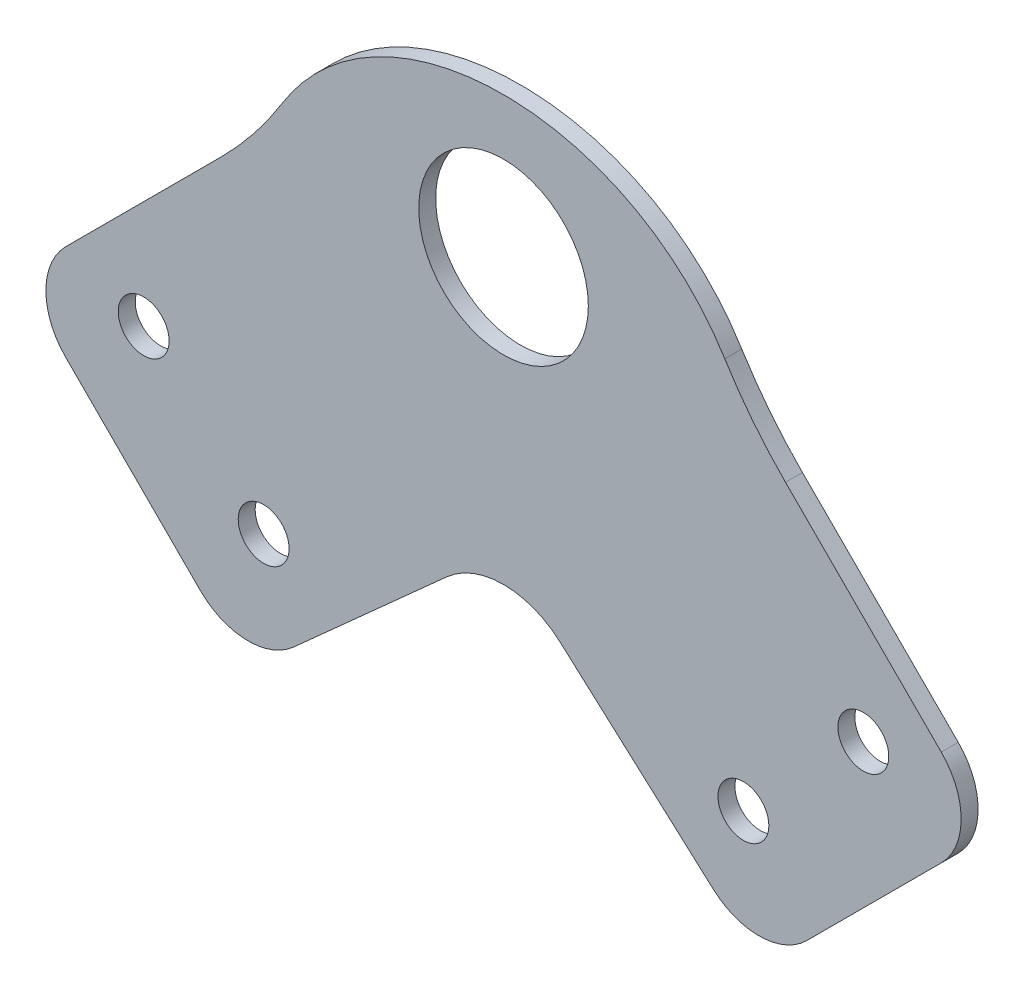
ISO-10303-21;
HEADER;
FILE_DESCRIPTION(('STEP AP214'),'2;1');
FILE_NAME('part.step','',(''),(''),'','','');
FILE_SCHEMA(('AUTOMOTIVE_DESIGN { 1 0 10303 214 1 1 1 1 }'));
ENDSEC;
DATA;
#1=APPLICATION_CONTEXT('core data for automotive mechanical design processes');
#2=APPLICATION_PROTOCOL_DEFINITION('international standard','automotive_design',2000,#1);
#3=PRODUCT_CONTEXT('',#1,'mechanical');
#4=PRODUCT('Part','Part','',(#3));
#5=PRODUCT_RELATED_PRODUCT_CATEGORY('part','',(#4));
#6=PRODUCT_DEFINITION_FORMATION('','',#4);
#7=PRODUCT_DEFINITION_CONTEXT('part definition',#1,'design');
#8=PRODUCT_DEFINITION('design','',#6,#7);
#9=PRODUCT_DEFINITION_SHAPE('','',#8);
#10=(LENGTH_UNIT() NAMED_UNIT(*) SI_UNIT(.MILLI.,.METRE.));
#11=(NAMED_UNIT(*) PLANE_ANGLE_UNIT() SI_UNIT($,.RADIAN.));
#12=(NAMED_UNIT(*) SI_UNIT($,.STERADIAN.) SOLID_ANGLE_UNIT());
#13=UNCERTAINTY_MEASURE_WITH_UNIT(LENGTH_MEASURE(1.E-05),#10,'distance_accuracy_value','');
#14=(GEOMETRIC_REPRESENTATION_CONTEXT(3) GLOBAL_UNCERTAINTY_ASSIGNED_CONTEXT((#13)) GLOBAL_UNIT_ASSIGNED_CONTEXT((#10,
#11,#12)) REPRESENTATION_CONTEXT('',''));
#15=CARTESIAN_POINT('',(0.,0.,0.));
#16=DIRECTION('',(0.,0.,1.));
#17=DIRECTION('',(1.,0.,0.));
#18=AXIS2_PLACEMENT_3D('',#15,#16,#17);
#19=CARTESIAN_POINT('',(0.,16.5940038776958,2.));
#20=DIRECTION('',(0.,0.,1.));
#21=DIRECTION('',(1.,0.,0.));
#22=AXIS2_PLACEMENT_3D('',#19,#20,#21);
#23=PLANE('',#22);
#24=CARTESIAN_POINT('',(28.2842712474616,-42.4264068711929,2.));
#25=DIRECTION('',(0.,0.,1.));
#26=DIRECTION('',(1.,0.,0.));
#27=AXIS2_PLACEMENT_3D('',#24,#25,#26);
#28=CIRCLE('',#27,2.99999999999998);
#29=CARTESIAN_POINT('',(31.2842712474616,-42.4264068711929,2.));
#30=VERTEX_POINT('',#29);
#31=EDGE_CURVE('E363',#30,#30,#28,.T.);
#32=ORIENTED_EDGE('',*,*,#31,.F.);
#33=EDGE_LOOP('',(#32));
#34=FACE_BOUND('',#33,.T.);
#35=CARTESIAN_POINT('',(-42.426406871192,-28.2842712474614,2.));
#36=DIRECTION('',(0.,0.,1.));
#37=DIRECTION('',(1.,0.,0.));
#38=AXIS2_PLACEMENT_3D('',#35,#36,#37);
#39=CIRCLE('',#38,2.99999999999921);
#40=CARTESIAN_POINT('',(-39.4264068711928,-28.2842712474614,2.));
#41=VERTEX_POINT('',#40);
#42=EDGE_CURVE('E375',#41,#41,#39,.T.);
#43=ORIENTED_EDGE('',*,*,#42,.F.);
#44=EDGE_LOOP('',(#43));
#45=FACE_BOUND('',#44,.T.);
#46=DIRECTION('',(0.707106781186551,0.707106781186544,0.));
#47=VECTOR('',#46,1.);
#48=CARTESIAN_POINT('',(57.2756492761099,-30.4055915910215,2.));
#49=LINE('',#48,#47);
#50=CARTESIAN_POINT('',(35.7638114428108,-51.9174294243203,2.));
#51=VERTEX_POINT('',#50);
#52=CARTESIAN_POINT('',(51.6187950266174,-36.0624458405139,2.));
#53=VERTEX_POINT('',#52);
#54=EDGE_CURVE('E266',#51,#53,#49,.T.);
#55=ORIENTED_EDGE('',*,*,#54,.T.);
#56=CARTESIAN_POINT('',(45.9619407771251,-30.4055915910215,2.));
#57=DIRECTION('',(0.,0.,1.));
#58=DIRECTION('',(1.,0.,0.));
#59=AXIS2_PLACEMENT_3D('',#56,#57,#58);
#60=CIRCLE('',#59,8.);
#61=CARTESIAN_POINT('',(51.6187950266175,-24.7487373415291,2.));
#62=VERTEX_POINT('',#61);
#63=EDGE_CURVE('E213',#53,#62,#60,.T.);
#64=ORIENTED_EDGE('',*,*,#63,.T.);
#65=DIRECTION('',(-0.707106781186543,0.707106781186552,0.));
#66=VECTOR('',#65,1.);
#67=CARTESIAN_POINT('',(57.2756492761099,-30.4055915910215,2.));
#68=LINE('',#67,#66);
#69=CARTESIAN_POINT('',(33.2480179131138,-6.37796022802521,2.));
#70=VERTEX_POINT('',#69);
#71=EDGE_CURVE('E263',#62,#70,#68,.T.);
#72=ORIENTED_EDGE('',*,*,#71,.T.);
#73=CARTESIAN_POINT('',(68.6033569724414,28.977378831302,2.));
#74=DIRECTION('',(0.,0.,1.));
#75=DIRECTION('',(1.,0.,0.));
#76=AXIS2_PLACEMENT_3D('',#73,#74,#75);
#77=CIRCLE('',#76,50.);
#78=CARTESIAN_POINT('',(26.0935815778477,2.65402425972053,2.));
#79=VERTEX_POINT('',#78);
#80=EDGE_CURVE('E11',#70,#79,#77,.F.);
#81=ORIENTED_EDGE('',*,*,#80,.T.);
#82=CARTESIAN_POINT('',(28.1258464558517,-1.25578877076302,2.));
#83=CARTESIAN_POINT('',(17.9043054080305,22.5439347605154,2.));
#84=CARTESIAN_POINT('',(-17.9043054080305,22.5439347605154,2.));
#85=CARTESIAN_POINT('',(-28.1258464558517,-1.25578877076302,2.));
#86=B_SPLINE_CURVE_WITH_KNOTS('',3,(#82,#83,#84,#85),.UNSPECIFIED.,.F.,.F.,(4,4),(0.,1.),.UNSPECIFIED.);
#87=CARTESIAN_POINT('',(-26.0935815778477,2.65402425972051,2.));
#88=VERTEX_POINT('',#87);
#89=EDGE_CURVE('E247',#79,#88,#86,.T.);
#90=ORIENTED_EDGE('',*,*,#89,.T.);
#91=CARTESIAN_POINT('',(-68.6033569724414,28.9773788313019,2.));
#92=DIRECTION('',(0.,0.,1.));
#93=DIRECTION('',(1.,0.,0.));
#94=AXIS2_PLACEMENT_3D('',#91,#92,#93);
#95=CIRCLE('',#94,50.);
#96=CARTESIAN_POINT('',(-33.2480179131139,-6.37796022802527,2.));
#97=VERTEX_POINT('',#96);
#98=EDGE_CURVE('E239',#88,#97,#95,.F.);
#99=ORIENTED_EDGE('',*,*,#98,.T.);
#100=DIRECTION('',(-0.707106781186544,-0.707106781186552,0.));
#101=VECTOR('',#100,1.);
#102=CARTESIAN_POINT('',(-57.2756492761099,-30.4055915910215,2.));
#103=LINE('',#102,#101);
#104=CARTESIAN_POINT('',(-51.6187950266175,-24.7487373415291,2.));
#105=VERTEX_POINT('',#104);
#106=EDGE_CURVE('E161',#97,#105,#103,.T.);
#107=ORIENTED_EDGE('',*,*,#106,.T.);
#108=CARTESIAN_POINT('',(-45.9619407771251,-30.4055915910215,2.));
#109=DIRECTION('',(0.,0.,1.));
#110=DIRECTION('',(1.,0.,0.));
#111=AXIS2_PLACEMENT_3D('',#108,#109,#110);
#112=CIRCLE('',#111,8.);
#113=CARTESIAN_POINT('',(-51.6187950266174,-36.0624458405139,2.));
#114=VERTEX_POINT('',#113);
#115=EDGE_CURVE('E209',#105,#114,#112,.T.);
#116=ORIENTED_EDGE('',*,*,#115,.T.);
#117=DIRECTION('',(0.707106781186551,-0.707106781186544,0.));
#118=VECTOR('',#117,1.);
#119=CARTESIAN_POINT('',(-57.2756492761099,-30.4055915910215,2.));
#120=LINE('',#119,#118);
#121=CARTESIAN_POINT('',(-35.7638114428108,-51.9174294243203,2.));
#122=VERTEX_POINT('',#121);
#123=EDGE_CURVE('E187',#114,#122,#120,.T.);
#124=ORIENTED_EDGE('',*,*,#123,.T.);
#125=CARTESIAN_POINT('',(-30.1069571933185,-46.2605751748279,2.));
#126=DIRECTION('',(0.,0.,1.));
#127=DIRECTION('',(1.,0.,0.));
#128=AXIS2_PLACEMENT_3D('',#125,#126,#127);
#129=CIRCLE('',#128,8.);
#130=CARTESIAN_POINT('',(-24.7649182585231,-52.215625134243,2.));
#131=VERTEX_POINT('',#130);
#132=EDGE_CURVE('E207',#122,#131,#129,.T.);
#133=ORIENTED_EDGE('',*,*,#132,.T.);
#134=DIRECTION('',(0.744381244926891,0.667754866849424,0.));
#135=VECTOR('',#134,1.);
#136=CARTESIAN_POINT('',(-30.4055915910209,-57.2756492761102,2.));
#137=LINE('',#136,#135);
#138=CARTESIAN_POINT('',(-6.67754866849424,-35.990163847356,2.));
#139=VERTEX_POINT('',#138);
#140=EDGE_CURVE('E388',#131,#139,#137,.T.);
#141=ORIENTED_EDGE('',*,*,#140,.T.);
#142=CARTESIAN_POINT('',(0.,-43.4339762966249,2.));
#143=DIRECTION('',(0.,0.,1.));
#144=DIRECTION('',(1.,0.,0.));
#145=AXIS2_PLACEMENT_3D('',#142,#143,#144);
#146=CIRCLE('',#145,10.);
#147=CARTESIAN_POINT('',(6.67754866849424,-35.990163847356,2.));
#148=VERTEX_POINT('',#147);
#149=EDGE_CURVE('E151',#139,#148,#146,.F.);
#150=ORIENTED_EDGE('',*,*,#149,.T.);
#151=DIRECTION('',(0.744381244926891,-0.667754866849424,0.));
#152=VECTOR('',#151,1.);
#153=CARTESIAN_POINT('',(30.4055915910209,-57.2756492761102,2.));
#154=LINE('',#153,#152);
#155=CARTESIAN_POINT('',(24.7649182585231,-52.215625134243,2.));
#156=VERTEX_POINT('',#155);
#157=EDGE_CURVE('E160',#148,#156,#154,.T.);
#158=ORIENTED_EDGE('',*,*,#157,.T.);
#159=CARTESIAN_POINT('',(30.1069571933185,-46.2605751748279,2.));
#160=DIRECTION('',(0.,0.,1.));
#161=DIRECTION('',(1.,0.,0.));
#162=AXIS2_PLACEMENT_3D('',#159,#160,#161);
#163=CIRCLE('',#162,8.);
#164=EDGE_CURVE('E211',#156,#51,#163,.T.);
#165=ORIENTED_EDGE('',*,*,#164,.T.);
#166=EDGE_LOOP('',(#55,#64,#72,#81,#90,#99,#107,#116,#124,#133,#141,#150,#158,#165));
#167=FACE_BOUND('',#166,.T.);
#168=CARTESIAN_POINT('',(0.,0.,2.));
#169=DIRECTION('',(0.,0.,1.));
#170=DIRECTION('',(1.,0.,0.));
#171=AXIS2_PLACEMENT_3D('',#168,#169,#170);
#172=CIRCLE('',#171,10.);
#173=CARTESIAN_POINT('',(10.,0.,2.));
#174=VERTEX_POINT('',#173);
#175=EDGE_CURVE('E381',#174,#174,#172,.T.);
#176=ORIENTED_EDGE('',*,*,#175,.F.);
#177=EDGE_LOOP('',(#176));
#178=FACE_BOUND('',#177,.T.);
#179=CARTESIAN_POINT('',(-28.2842712474616,-42.4264068711929,2.));
#180=DIRECTION('',(0.,0.,1.));
#181=DIRECTION('',(-1.,0.,0.));
#182=AXIS2_PLACEMENT_3D('',#179,#180,#181);
#183=CIRCLE('',#182,2.99999999999999);
#184=CARTESIAN_POINT('',(-31.2842712474616,-42.4264068711929,2.));
#185=VERTEX_POINT('',#184);
#186=EDGE_CURVE('E369',#185,#185,#183,.T.);
#187=ORIENTED_EDGE('',*,*,#186,.F.);
#188=EDGE_LOOP('',(#187));
#189=FACE_BOUND('',#188,.T.);
#190=CARTESIAN_POINT('',(42.4264068711926,-28.2842712474621,2.));
#191=DIRECTION('',(0.,0.,1.));
#192=DIRECTION('',(-1.,0.,0.));
#193=AXIS2_PLACEMENT_3D('',#190,#191,#192);
#194=CIRCLE('',#193,3.);
#195=CARTESIAN_POINT('',(39.4264068711926,-28.2842712474621,2.));
#196=VERTEX_POINT('',#195);
#197=EDGE_CURVE('E354',#196,#196,#194,.T.);
#198=ORIENTED_EDGE('',*,*,#197,.F.);
#199=EDGE_LOOP('',(#198));
#200=FACE_BOUND('',#199,.T.);
#201=ADVANCED_FACE('F40',(#34,#45,#167,#178,#189,#200),#23,.T.);
#202=CARTESIAN_POINT('',(0.,16.5940038776958,0.));
#203=DIRECTION('',(0.,0.,1.));
#204=DIRECTION('',(1.,0.,0.));
#205=AXIS2_PLACEMENT_3D('',#202,#203,#204);
#206=PLANE('',#205);
#207=DIRECTION('',(-0.707106781186543,0.707106781186552,0.));
#208=VECTOR('',#207,1.);
#209=CARTESIAN_POINT('',(57.2756492761099,-30.4055915910215,0.));
#210=LINE('',#209,#208);
#211=CARTESIAN_POINT('',(51.6187950266175,-24.7487373415291,0.));
#212=VERTEX_POINT('',#211);
#213=CARTESIAN_POINT('',(33.2480179131138,-6.37796022802521,0.));
#214=VERTEX_POINT('',#213);
#215=EDGE_CURVE('E171',#212,#214,#210,.T.);
#216=ORIENTED_EDGE('',*,*,#215,.F.);
#217=CARTESIAN_POINT('',(45.9619407771251,-30.4055915910215,0.));
#218=DIRECTION('',(0.,0.,1.));
#219=DIRECTION('',(1.,0.,0.));
#220=AXIS2_PLACEMENT_3D('',#217,#218,#219);
#221=CIRCLE('',#220,8.);
#222=CARTESIAN_POINT('',(51.6187950266174,-36.0624458405139,0.));
#223=VERTEX_POINT('',#222);
#224=EDGE_CURVE('E200',#212,#223,#221,.F.);
#225=ORIENTED_EDGE('',*,*,#224,.T.);
#226=DIRECTION('',(0.707106781186551,0.707106781186544,0.));
#227=VECTOR('',#226,1.);
#228=CARTESIAN_POINT('',(57.2756492761099,-30.4055915910215,0.));
#229=LINE('',#228,#227);
#230=CARTESIAN_POINT('',(35.7638114428108,-51.9174294243203,0.));
#231=VERTEX_POINT('',#230);
#232=EDGE_CURVE('E167',#231,#223,#229,.T.);
#233=ORIENTED_EDGE('',*,*,#232,.F.);
#234=CARTESIAN_POINT('',(30.1069571933185,-46.2605751748279,0.));
#235=DIRECTION('',(0.,0.,1.));
#236=DIRECTION('',(1.,0.,0.));
#237=AXIS2_PLACEMENT_3D('',#234,#235,#236);
#238=CIRCLE('',#237,8.);
#239=CARTESIAN_POINT('',(24.7649182585231,-52.215625134243,0.));
#240=VERTEX_POINT('',#239);
#241=EDGE_CURVE('E166',#231,#240,#238,.F.);
#242=ORIENTED_EDGE('',*,*,#241,.T.);
#243=DIRECTION('',(0.744381244926891,-0.667754866849424,0.));
#244=VECTOR('',#243,1.);
#245=CARTESIAN_POINT('',(30.4055915910209,-57.2756492761102,0.));
#246=LINE('',#245,#244);
#247=CARTESIAN_POINT('',(6.67754866849424,-35.990163847356,0.));
#248=VERTEX_POINT('',#247);
#249=EDGE_CURVE('E157',#248,#240,#246,.T.);
#250=ORIENTED_EDGE('',*,*,#249,.F.);
#251=CARTESIAN_POINT('',(0.,-43.4339762966249,0.));
#252=DIRECTION('',(0.,0.,1.));
#253=DIRECTION('',(1.,0.,0.));
#254=AXIS2_PLACEMENT_3D('',#251,#252,#253);
#255=CIRCLE('',#254,10.);
#256=CARTESIAN_POINT('',(-6.67754866849424,-35.990163847356,0.));
#257=VERTEX_POINT('',#256);
#258=EDGE_CURVE('E142',#248,#257,#255,.T.);
#259=ORIENTED_EDGE('',*,*,#258,.T.);
#260=DIRECTION('',(0.744381244926891,0.667754866849424,0.));
#261=VECTOR('',#260,1.);
#262=CARTESIAN_POINT('',(-30.4055915910209,-57.2756492761102,0.));
#263=LINE('',#262,#261);
#264=CARTESIAN_POINT('',(-24.7649182585231,-52.215625134243,0.));
#265=VERTEX_POINT('',#264);
#266=EDGE_CURVE('E168',#265,#257,#263,.T.);
#267=ORIENTED_EDGE('',*,*,#266,.F.);
#268=CARTESIAN_POINT('',(-30.1069571933185,-46.2605751748279,0.));
#269=DIRECTION('',(0.,0.,1.));
#270=DIRECTION('',(1.,0.,0.));
#271=AXIS2_PLACEMENT_3D('',#268,#269,#270);
#272=CIRCLE('',#271,8.);
#273=CARTESIAN_POINT('',(-35.7638114428108,-51.9174294243203,0.));
#274=VERTEX_POINT('',#273);
#275=EDGE_CURVE('E194',#265,#274,#272,.F.);
#276=ORIENTED_EDGE('',*,*,#275,.T.);
#277=DIRECTION('',(0.707106781186551,-0.707106781186544,0.));
#278=VECTOR('',#277,1.);
#279=CARTESIAN_POINT('',(-57.2756492761099,-30.4055915910215,0.));
#280=LINE('',#279,#278);
#281=CARTESIAN_POINT('',(-51.6187950266174,-36.0624458405139,0.));
#282=VERTEX_POINT('',#281);
#283=EDGE_CURVE('E173',#282,#274,#280,.T.);
#284=ORIENTED_EDGE('',*,*,#283,.F.);
#285=CARTESIAN_POINT('',(-45.9619407771251,-30.4055915910215,0.));
#286=DIRECTION('',(0.,0.,1.));
#287=DIRECTION('',(1.,0.,0.));
#288=AXIS2_PLACEMENT_3D('',#285,#286,#287);
#289=CIRCLE('',#288,8.);
#290=CARTESIAN_POINT('',(-51.6187950266175,-24.7487373415291,0.));
#291=VERTEX_POINT('',#290);
#292=EDGE_CURVE('E196',#282,#291,#289,.F.);
#293=ORIENTED_EDGE('',*,*,#292,.T.);
#294=DIRECTION('',(-0.707106781186544,-0.707106781186552,0.));
#295=VECTOR('',#294,1.);
#296=CARTESIAN_POINT('',(-57.2756492761099,-30.4055915910215,0.));
#297=LINE('',#296,#295);
#298=CARTESIAN_POINT('',(-33.2480179131139,-6.37796022802527,0.));
#299=VERTEX_POINT('',#298);
#300=EDGE_CURVE('E183',#299,#291,#297,.T.);
#301=ORIENTED_EDGE('',*,*,#300,.F.);
#302=CARTESIAN_POINT('',(-68.6033569724414,28.9773788313019,0.));
#303=DIRECTION('',(0.,0.,1.));
#304=DIRECTION('',(1.,0.,0.));
#305=AXIS2_PLACEMENT_3D('',#302,#303,#304);
#306=CIRCLE('',#305,50.);
#307=CARTESIAN_POINT('',(-26.0935815778477,2.65402425972051,0.));
#308=VERTEX_POINT('',#307);
#309=EDGE_CURVE('E237',#299,#308,#306,.T.);
#310=ORIENTED_EDGE('',*,*,#309,.T.);
#311=CARTESIAN_POINT('',(28.1258464558517,-1.25578877076302,0.));
#312=CARTESIAN_POINT('',(17.9043054080305,22.5439347605154,0.));
#313=CARTESIAN_POINT('',(-17.9043054080305,22.5439347605154,0.));
#314=CARTESIAN_POINT('',(-28.1258464558517,-1.25578877076302,0.));
#315=B_SPLINE_CURVE_WITH_KNOTS('',3,(#311,#312,#313,#314),.UNSPECIFIED.,.F.,.F.,(4,4),(0.,1.),.UNSPECIFIED.);
#316=CARTESIAN_POINT('',(26.0935815778477,2.65402425972053,0.));
#317=VERTEX_POINT('',#316);
#318=EDGE_CURVE('E178',#317,#308,#315,.T.);
#319=ORIENTED_EDGE('',*,*,#318,.F.);
#320=CARTESIAN_POINT('',(68.6033569724414,28.977378831302,0.));
#321=DIRECTION('',(0.,0.,1.));
#322=DIRECTION('',(1.,0.,0.));
#323=AXIS2_PLACEMENT_3D('',#320,#321,#322);
#324=CIRCLE('',#323,50.);
#325=EDGE_CURVE('E48',#317,#214,#324,.T.);
#326=ORIENTED_EDGE('',*,*,#325,.T.);
#327=EDGE_LOOP('',(#216,#225,#233,#242,#250,#259,#267,#276,#284,#293,#301,#310,#319,#326));
#328=FACE_BOUND('',#327,.T.);
#329=CARTESIAN_POINT('',(0.,0.,0.));
#330=DIRECTION('',(0.,0.,1.));
#331=DIRECTION('',(1.,0.,0.));
#332=AXIS2_PLACEMENT_3D('',#329,#330,#331);
#333=CIRCLE('',#332,10.);
#334=CARTESIAN_POINT('',(10.,0.,0.));
#335=VERTEX_POINT('',#334);
#336=EDGE_CURVE('E378',#335,#335,#333,.T.);
#337=ORIENTED_EDGE('',*,*,#336,.T.);
#338=EDGE_LOOP('',(#337));
#339=FACE_BOUND('',#338,.T.);
#340=CARTESIAN_POINT('',(-42.426406871192,-28.2842712474614,0.));
#341=DIRECTION('',(0.,0.,1.));
#342=DIRECTION('',(1.,0.,0.));
#343=AXIS2_PLACEMENT_3D('',#340,#341,#342);
#344=CIRCLE('',#343,2.99999999999921);
#345=CARTESIAN_POINT('',(-39.4264068711928,-28.2842712474614,0.));
#346=VERTEX_POINT('',#345);
#347=EDGE_CURVE('E372',#346,#346,#344,.T.);
#348=ORIENTED_EDGE('',*,*,#347,.T.);
#349=EDGE_LOOP('',(#348));
#350=FACE_BOUND('',#349,.T.);
#351=CARTESIAN_POINT('',(-28.2842712474616,-42.4264068711929,0.));
#352=DIRECTION('',(0.,0.,1.));
#353=DIRECTION('',(-1.,0.,0.));
#354=AXIS2_PLACEMENT_3D('',#351,#352,#353);
#355=CIRCLE('',#354,2.99999999999999);
#356=CARTESIAN_POINT('',(-31.2842712474616,-42.4264068711929,0.));
#357=VERTEX_POINT('',#356);
#358=EDGE_CURVE('E366',#357,#357,#355,.T.);
#359=ORIENTED_EDGE('',*,*,#358,.T.);
#360=EDGE_LOOP('',(#359));
#361=FACE_BOUND('',#360,.T.);
#362=CARTESIAN_POINT('',(28.2842712474616,-42.4264068711929,0.));
#363=DIRECTION('',(0.,0.,1.));
#364=DIRECTION('',(1.,0.,0.));
#365=AXIS2_PLACEMENT_3D('',#362,#363,#364);
#366=CIRCLE('',#365,2.99999999999998);
#367=CARTESIAN_POINT('',(31.2842712474616,-42.4264068711929,0.));
#368=VERTEX_POINT('',#367);
#369=EDGE_CURVE('E360',#368,#368,#366,.T.);
#370=ORIENTED_EDGE('',*,*,#369,.T.);
#371=EDGE_LOOP('',(#370));
#372=FACE_BOUND('',#371,.T.);
#373=CARTESIAN_POINT('',(42.4264068711926,-28.2842712474621,0.));
#374=DIRECTION('',(0.,0.,1.));
#375=DIRECTION('',(-1.,0.,0.));
#376=AXIS2_PLACEMENT_3D('',#373,#374,#375);
#377=CIRCLE('',#376,3.);
#378=CARTESIAN_POINT('',(39.4264068711926,-28.2842712474621,0.));
#379=VERTEX_POINT('',#378);
#380=EDGE_CURVE('E357',#379,#379,#377,.T.);
#381=ORIENTED_EDGE('',*,*,#380,.T.);
#382=EDGE_LOOP('',(#381));
#383=FACE_BOUND('',#382,.T.);
#384=ADVANCED_FACE('F163',(#328,#339,#350,#361,#372,#383),#206,.F.);
#385=CARTESIAN_POINT('',(-57.2756492761099,-30.4055915910215,2.));
#386=DIRECTION('',(0.707106781186544,0.707106781186552,0.));
#387=DIRECTION('',(-0.707106781186552,0.707106781186544,0.));
#388=AXIS2_PLACEMENT_3D('',#385,#386,#387);
#389=PLANE('',#388);
#390=ORIENTED_EDGE('',*,*,#123,.F.);
#391=DIRECTION('',(0.,0.,-1.));
#392=VECTOR('',#391,1.);
#393=CARTESIAN_POINT('',(-51.6187950266174,-36.0624458405139,2.));
#394=LINE('',#393,#392);
#395=EDGE_CURVE('E219',#114,#282,#394,.T.);
#396=ORIENTED_EDGE('',*,*,#395,.T.);
#397=ORIENTED_EDGE('',*,*,#283,.T.);
#398=DIRECTION('',(0.,0.,-1.));
#399=VECTOR('',#398,1.);
#400=CARTESIAN_POINT('',(-35.7638114428108,-51.9174294243203,2.));
#401=LINE('',#400,#399);
#402=EDGE_CURVE('E217',#274,#122,#401,.F.);
#403=ORIENTED_EDGE('',*,*,#402,.T.);
#404=EDGE_LOOP('',(#390,#396,#397,#403));
#405=FACE_BOUND('',#404,.T.);
#406=ADVANCED_FACE('F294',(#405),#389,.F.);
#407=CARTESIAN_POINT('',(-30.4055915910209,-57.2756492761102,2.));
#408=DIRECTION('',(-0.667754866849424,0.744381244926891,0.));
#409=DIRECTION('',(-0.744381244926891,-0.667754866849424,0.));
#410=AXIS2_PLACEMENT_3D('',#407,#408,#409);
#411=PLANE('',#410);
#412=ORIENTED_EDGE('',*,*,#140,.F.);
#413=DIRECTION('',(0.,0.,-1.));
#414=VECTOR('',#413,1.);
#415=CARTESIAN_POINT('',(-24.7649182585231,-52.215625134243,2.));
#416=LINE('',#415,#414);
#417=EDGE_CURVE('E225',#131,#265,#416,.T.);
#418=ORIENTED_EDGE('',*,*,#417,.T.);
#419=ORIENTED_EDGE('',*,*,#266,.T.);
#420=DIRECTION('',(0.,0.,-1.));
#421=VECTOR('',#420,1.);
#422=CARTESIAN_POINT('',(-6.67754866849425,-35.990163847356,2.));
#423=LINE('',#422,#421);
#424=EDGE_CURVE('E148',#257,#139,#423,.F.);
#425=ORIENTED_EDGE('',*,*,#424,.T.);
#426=EDGE_LOOP('',(#412,#418,#419,#425));
#427=FACE_BOUND('',#426,.T.);
#428=ADVANCED_FACE('F291',(#427),#411,.F.);
#429=CARTESIAN_POINT('',(30.4055915910209,-57.2756492761102,2.));
#430=DIRECTION('',(0.667754866849424,0.744381244926891,0.));
#431=DIRECTION('',(-0.744381244926891,0.667754866849424,0.));
#432=AXIS2_PLACEMENT_3D('',#429,#430,#431);
#433=PLANE('',#432);
#434=ORIENTED_EDGE('',*,*,#249,.T.);
#435=DIRECTION('',(0.,0.,-1.));
#436=VECTOR('',#435,1.);
#437=CARTESIAN_POINT('',(24.7649182585231,-52.215625134243,2.));
#438=LINE('',#437,#436);
#439=EDGE_CURVE('E215',#240,#156,#438,.F.);
#440=ORIENTED_EDGE('',*,*,#439,.T.);
#441=ORIENTED_EDGE('',*,*,#157,.F.);
#442=DIRECTION('',(0.,0.,-1.));
#443=VECTOR('',#442,1.);
#444=CARTESIAN_POINT('',(6.67754866849425,-35.990163847356,0.));
#445=LINE('',#444,#443);
#446=EDGE_CURVE('E146',#148,#248,#445,.T.);
#447=ORIENTED_EDGE('',*,*,#446,.T.);
#448=EDGE_LOOP('',(#434,#440,#441,#447));
#449=FACE_BOUND('',#448,.T.);
#450=ADVANCED_FACE('F156',(#449),#433,.F.);
#451=CARTESIAN_POINT('',(57.2756492761099,-30.4055915910215,2.));
#452=DIRECTION('',(-0.707106781186544,0.707106781186552,0.));
#453=DIRECTION('',(-0.707106781186552,-0.707106781186544,0.));
#454=AXIS2_PLACEMENT_3D('',#451,#452,#453);
#455=PLANE('',#454);
#456=ORIENTED_EDGE('',*,*,#232,.T.);
#457=DIRECTION('',(0.,0.,-1.));
#458=VECTOR('',#457,1.);
#459=CARTESIAN_POINT('',(51.6187950266174,-36.0624458405139,2.));
#460=LINE('',#459,#458);
#461=EDGE_CURVE('E205',#223,#53,#460,.F.);
#462=ORIENTED_EDGE('',*,*,#461,.T.);
#463=ORIENTED_EDGE('',*,*,#54,.F.);
#464=DIRECTION('',(0.,0.,-1.));
#465=VECTOR('',#464,1.);
#466=CARTESIAN_POINT('',(35.7638114428108,-51.9174294243203,2.));
#467=LINE('',#466,#465);
#468=EDGE_CURVE('E202',#51,#231,#467,.T.);
#469=ORIENTED_EDGE('',*,*,#468,.T.);
#470=EDGE_LOOP('',(#456,#462,#463,#469));
#471=FACE_BOUND('',#470,.T.);
#472=ADVANCED_FACE('F285',(#471),#455,.F.);
#473=CARTESIAN_POINT('',(57.2756492761099,-30.4055915910215,2.));
#474=DIRECTION('',(-0.707106781186552,-0.707106781186543,0.));
#475=DIRECTION('',(0.707106781186543,-0.707106781186552,0.));
#476=AXIS2_PLACEMENT_3D('',#473,#474,#475);
#477=PLANE('',#476);
#478=ORIENTED_EDGE('',*,*,#215,.T.);
#479=DIRECTION('',(0.,0.,1.));
#480=VECTOR('',#479,1.);
#481=CARTESIAN_POINT('',(33.2480179131138,-6.37796022802521,2.));
#482=LINE('',#481,#480);
#483=EDGE_CURVE('E61',#214,#70,#482,.T.);
#484=ORIENTED_EDGE('',*,*,#483,.T.);
#485=ORIENTED_EDGE('',*,*,#71,.F.);
#486=DIRECTION('',(0.,0.,-1.));
#487=VECTOR('',#486,1.);
#488=CARTESIAN_POINT('',(51.6187950266175,-24.7487373415291,2.));
#489=LINE('',#488,#487);
#490=EDGE_CURVE('E191',#62,#212,#489,.T.);
#491=ORIENTED_EDGE('',*,*,#490,.T.);
#492=EDGE_LOOP('',(#478,#484,#485,#491));
#493=FACE_BOUND('',#492,.T.);
#494=ADVANCED_FACE('F281',(#493),#477,.F.);
#495=DIRECTION('',(0.,0.,-1.));
#496=VECTOR('',#495,1.);
#497=SURFACE_OF_LINEAR_EXTRUSION('',#86,#496);
#498=ORIENTED_EDGE('',*,*,#318,.T.);
#499=DIRECTION('',(0.,0.,-1.));
#500=VECTOR('',#499,1.);
#501=CARTESIAN_POINT('',(-26.0935815778477,2.65402425972051,0.));
#502=LINE('',#501,#500);
#503=EDGE_CURVE('E234',#308,#88,#502,.F.);
#504=ORIENTED_EDGE('',*,*,#503,.T.);
#505=ORIENTED_EDGE('',*,*,#89,.F.);
#506=DIRECTION('',(0.,0.,-1.));
#507=VECTOR('',#506,1.);
#508=CARTESIAN_POINT('',(26.0935815778477,2.65402425972053,2.));
#509=LINE('',#508,#507);
#510=EDGE_CURVE('E231',#79,#317,#509,.T.);
#511=ORIENTED_EDGE('',*,*,#510,.T.);
#512=EDGE_LOOP('',(#498,#504,#505,#511));
#513=FACE_BOUND('',#512,.T.);
#514=ADVANCED_FACE('F259',(#513),#497,.F.);
#515=CARTESIAN_POINT('',(-57.2756492761099,-30.4055915910215,2.));
#516=DIRECTION('',(0.707106781186552,-0.707106781186544,0.));
#517=DIRECTION('',(0.707106781186544,0.707106781186552,0.));
#518=AXIS2_PLACEMENT_3D('',#515,#516,#517);
#519=PLANE('',#518);
#520=ORIENTED_EDGE('',*,*,#106,.F.);
#521=DIRECTION('',(0.,0.,1.));
#522=VECTOR('',#521,1.);
#523=CARTESIAN_POINT('',(-33.2480179131139,-6.37796022802527,0.));
#524=LINE('',#523,#522);
#525=EDGE_CURVE('E228',#97,#299,#524,.F.);
#526=ORIENTED_EDGE('',*,*,#525,.T.);
#527=ORIENTED_EDGE('',*,*,#300,.T.);
#528=DIRECTION('',(0.,0.,-1.));
#529=VECTOR('',#528,1.);
#530=CARTESIAN_POINT('',(-51.6187950266175,-24.7487373415291,2.));
#531=LINE('',#530,#529);
#532=EDGE_CURVE('E222',#291,#105,#531,.F.);
#533=ORIENTED_EDGE('',*,*,#532,.T.);
#534=EDGE_LOOP('',(#520,#526,#527,#533));
#535=FACE_BOUND('',#534,.T.);
#536=ADVANCED_FACE('F252',(#535),#519,.F.);
#537=CARTESIAN_POINT('',(0.,0.,2.));
#538=DIRECTION('',(0.,0.,-1.));
#539=DIRECTION('',(-1.,0.,0.));
#540=AXIS2_PLACEMENT_3D('',#537,#538,#539);
#541=CYLINDRICAL_SURFACE('',#540,10.);
#542=ORIENTED_EDGE('',*,*,#175,.T.);
#543=EDGE_LOOP('',(#542));
#544=FACE_BOUND('',#543,.T.);
#545=ORIENTED_EDGE('',*,*,#336,.F.);
#546=EDGE_LOOP('',(#545));
#547=FACE_BOUND('',#546,.T.);
#548=ADVANCED_FACE('F331',(#544,#547),#541,.F.);
#549=CARTESIAN_POINT('',(-42.426406871192,-28.2842712474614,2.));
#550=DIRECTION('',(0.,0.,-1.));
#551=DIRECTION('',(-1.,0.,0.));
#552=AXIS2_PLACEMENT_3D('',#549,#550,#551);
#553=CYLINDRICAL_SURFACE('',#552,2.99999999999921);
#554=ORIENTED_EDGE('',*,*,#42,.T.);
#555=EDGE_LOOP('',(#554));
#556=FACE_BOUND('',#555,.T.);
#557=ORIENTED_EDGE('',*,*,#347,.F.);
#558=EDGE_LOOP('',(#557));
#559=FACE_BOUND('',#558,.T.);
#560=ADVANCED_FACE('F334',(#556,#559),#553,.F.);
#561=CARTESIAN_POINT('',(-28.2842712474616,-42.4264068711929,2.));
#562=DIRECTION('',(0.,0.,-1.));
#563=DIRECTION('',(-1.,0.,0.));
#564=AXIS2_PLACEMENT_3D('',#561,#562,#563);
#565=CYLINDRICAL_SURFACE('',#564,2.99999999999999);
#566=ORIENTED_EDGE('',*,*,#186,.T.);
#567=EDGE_LOOP('',(#566));
#568=FACE_BOUND('',#567,.T.);
#569=ORIENTED_EDGE('',*,*,#358,.F.);
#570=EDGE_LOOP('',(#569));
#571=FACE_BOUND('',#570,.T.);
#572=ADVANCED_FACE('F338',(#568,#571),#565,.F.);
#573=CARTESIAN_POINT('',(28.2842712474616,-42.4264068711929,2.));
#574=DIRECTION('',(0.,0.,-1.));
#575=DIRECTION('',(-1.,0.,0.));
#576=AXIS2_PLACEMENT_3D('',#573,#574,#575);
#577=CYLINDRICAL_SURFACE('',#576,2.99999999999998);
#578=ORIENTED_EDGE('',*,*,#31,.T.);
#579=EDGE_LOOP('',(#578));
#580=FACE_BOUND('',#579,.T.);
#581=ORIENTED_EDGE('',*,*,#369,.F.);
#582=EDGE_LOOP('',(#581));
#583=FACE_BOUND('',#582,.T.);
#584=ADVANCED_FACE('F342',(#580,#583),#577,.F.);
#585=CARTESIAN_POINT('',(42.4264068711926,-28.2842712474621,2.));
#586=DIRECTION('',(0.,0.,-1.));
#587=DIRECTION('',(-1.,0.,0.));
#588=AXIS2_PLACEMENT_3D('',#585,#586,#587);
#589=CYLINDRICAL_SURFACE('',#588,3.);
#590=ORIENTED_EDGE('',*,*,#197,.T.);
#591=EDGE_LOOP('',(#590));
#592=FACE_BOUND('',#591,.T.);
#593=ORIENTED_EDGE('',*,*,#380,.F.);
#594=EDGE_LOOP('',(#593));
#595=FACE_BOUND('',#594,.T.);
#596=ADVANCED_FACE('F302',(#592,#595),#589,.F.);
#597=CARTESIAN_POINT('',(0.,-43.4339762966249,2.));
#598=DIRECTION('',(0.,0.,1.));
#599=DIRECTION('',(1.,0.,0.));
#600=AXIS2_PLACEMENT_3D('',#597,#598,#599);
#601=CYLINDRICAL_SURFACE('',#600,10.);
#602=ORIENTED_EDGE('',*,*,#149,.F.);
#603=ORIENTED_EDGE('',*,*,#424,.F.);
#604=ORIENTED_EDGE('',*,*,#258,.F.);
#605=ORIENTED_EDGE('',*,*,#446,.F.);
#606=EDGE_LOOP('',(#602,#603,#604,#605));
#607=FACE_BOUND('',#606,.T.);
#608=ADVANCED_FACE('F145',(#607),#601,.F.);
#609=CARTESIAN_POINT('',(45.9619407771251,-30.4055915910215,2.));
#610=DIRECTION('',(0.,0.,-1.));
#611=DIRECTION('',(-1.,0.,0.));
#612=AXIS2_PLACEMENT_3D('',#609,#610,#611);
#613=CYLINDRICAL_SURFACE('',#612,8.);
#614=ORIENTED_EDGE('',*,*,#63,.F.);
#615=ORIENTED_EDGE('',*,*,#461,.F.);
#616=ORIENTED_EDGE('',*,*,#224,.F.);
#617=ORIENTED_EDGE('',*,*,#490,.F.);
#618=EDGE_LOOP('',(#614,#615,#616,#617));
#619=FACE_BOUND('',#618,.T.);
#620=ADVANCED_FACE('F301',(#619),#613,.T.);
#621=CARTESIAN_POINT('',(30.1069571933185,-46.2605751748279,2.));
#622=DIRECTION('',(0.,0.,-1.));
#623=DIRECTION('',(-1.,0.,0.));
#624=AXIS2_PLACEMENT_3D('',#621,#622,#623);
#625=CYLINDRICAL_SURFACE('',#624,8.);
#626=ORIENTED_EDGE('',*,*,#164,.F.);
#627=ORIENTED_EDGE('',*,*,#439,.F.);
#628=ORIENTED_EDGE('',*,*,#241,.F.);
#629=ORIENTED_EDGE('',*,*,#468,.F.);
#630=EDGE_LOOP('',(#626,#627,#628,#629));
#631=FACE_BOUND('',#630,.T.);
#632=ADVANCED_FACE('F305',(#631),#625,.T.);
#633=CARTESIAN_POINT('',(-45.9619407771251,-30.4055915910215,2.));
#634=DIRECTION('',(0.,0.,-1.));
#635=DIRECTION('',(-1.,0.,0.));
#636=AXIS2_PLACEMENT_3D('',#633,#634,#635);
#637=CYLINDRICAL_SURFACE('',#636,8.);
#638=ORIENTED_EDGE('',*,*,#115,.F.);
#639=ORIENTED_EDGE('',*,*,#532,.F.);
#640=ORIENTED_EDGE('',*,*,#292,.F.);
#641=ORIENTED_EDGE('',*,*,#395,.F.);
#642=EDGE_LOOP('',(#638,#639,#640,#641));
#643=FACE_BOUND('',#642,.T.);
#644=ADVANCED_FACE('F309',(#643),#637,.T.);
#645=CARTESIAN_POINT('',(-30.1069571933185,-46.2605751748279,2.));
#646=DIRECTION('',(0.,0.,-1.));
#647=DIRECTION('',(-1.,0.,0.));
#648=AXIS2_PLACEMENT_3D('',#645,#646,#647);
#649=CYLINDRICAL_SURFACE('',#648,8.);
#650=ORIENTED_EDGE('',*,*,#132,.F.);
#651=ORIENTED_EDGE('',*,*,#402,.F.);
#652=ORIENTED_EDGE('',*,*,#275,.F.);
#653=ORIENTED_EDGE('',*,*,#417,.F.);
#654=EDGE_LOOP('',(#650,#651,#652,#653));
#655=FACE_BOUND('',#654,.T.);
#656=ADVANCED_FACE('F313',(#655),#649,.T.);
#657=CARTESIAN_POINT('',(-68.6033569724414,28.9773788313019,1.));
#658=DIRECTION('',(0.,0.,-1.));
#659=DIRECTION('',(-1.,0.,0.));
#660=AXIS2_PLACEMENT_3D('',#657,#658,#659);
#661=CYLINDRICAL_SURFACE('',#660,50.);
#662=ORIENTED_EDGE('',*,*,#98,.F.);
#663=ORIENTED_EDGE('',*,*,#503,.F.);
#664=ORIENTED_EDGE('',*,*,#309,.F.);
#665=ORIENTED_EDGE('',*,*,#525,.F.);
#666=EDGE_LOOP('',(#662,#663,#664,#665));
#667=FACE_BOUND('',#666,.T.);
#668=ADVANCED_FACE('F257',(#667),#661,.F.);
#669=CARTESIAN_POINT('',(68.6033569724414,28.977378831302,1.));
#670=DIRECTION('',(0.,0.,-1.));
#671=DIRECTION('',(-1.,0.,0.));
#672=AXIS2_PLACEMENT_3D('',#669,#670,#671);
#673=CYLINDRICAL_SURFACE('',#672,50.);
#674=ORIENTED_EDGE('',*,*,#80,.F.);
#675=ORIENTED_EDGE('',*,*,#483,.F.);
#676=ORIENTED_EDGE('',*,*,#325,.F.);
#677=ORIENTED_EDGE('',*,*,#510,.F.);
#678=EDGE_LOOP('',(#674,#675,#676,#677));
#679=FACE_BOUND('',#678,.T.);
#680=ADVANCED_FACE('F42',(#679),#673,.F.);
#681=CLOSED_SHELL('',(#201,#384,#406,#428,#450,#472,#494,#514,#536,#548,#560,#572,#584,#596,
#608,#620,#632,#644,#656,#668,#680));
#682=MANIFOLD_SOLID_BREP('B2',#681);
#683=ADVANCED_BREP_SHAPE_REPRESENTATION('',(#18,#682),#14);
#684=SHAPE_DEFINITION_REPRESENTATION(#9,#683);
ENDSEC;
END-ISO-10303-21;
